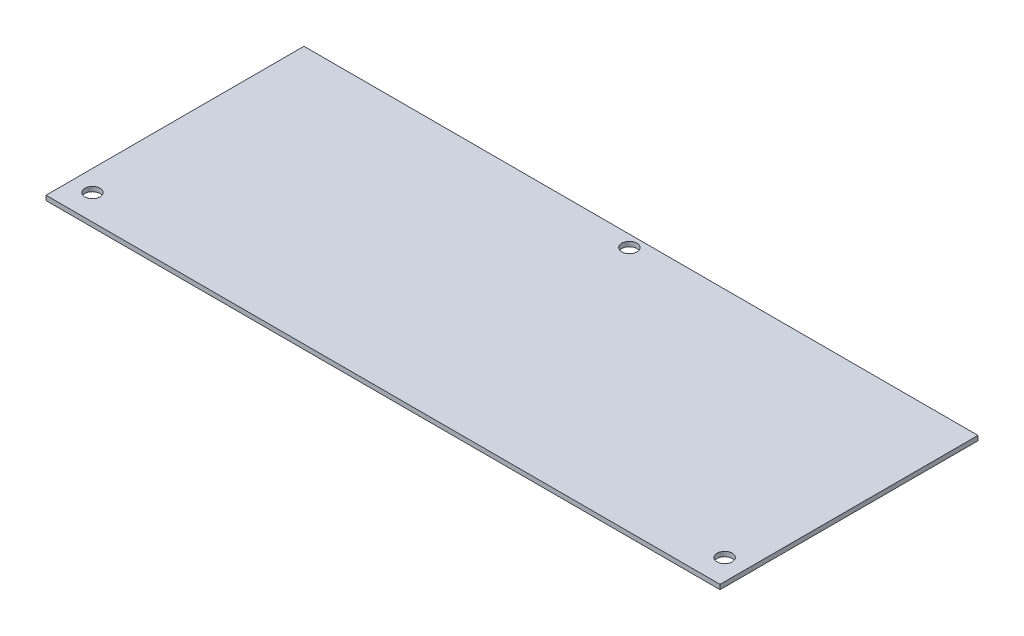
ISO-10303-21;
HEADER;
FILE_DESCRIPTION(('STEP AP214'),'2;1');
FILE_NAME('part.step','',(''),(''),'','','');
FILE_SCHEMA(('AUTOMOTIVE_DESIGN { 1 0 10303 214 1 1 1 1 }'));
ENDSEC;
DATA;
#1=APPLICATION_CONTEXT('core data for automotive mechanical design processes');
#2=APPLICATION_PROTOCOL_DEFINITION('international standard','automotive_design',2000,#1);
#3=PRODUCT_CONTEXT('',#1,'mechanical');
#4=PRODUCT('Part','Part','',(#3));
#5=PRODUCT_RELATED_PRODUCT_CATEGORY('part','',(#4));
#6=PRODUCT_DEFINITION_FORMATION('','',#4);
#7=PRODUCT_DEFINITION_CONTEXT('part definition',#1,'design');
#8=PRODUCT_DEFINITION('design','',#6,#7);
#9=PRODUCT_DEFINITION_SHAPE('','',#8);
#10=(LENGTH_UNIT() NAMED_UNIT(*) SI_UNIT(.MILLI.,.METRE.));
#11=(NAMED_UNIT(*) PLANE_ANGLE_UNIT() SI_UNIT($,.RADIAN.));
#12=(NAMED_UNIT(*) SI_UNIT($,.STERADIAN.) SOLID_ANGLE_UNIT());
#13=UNCERTAINTY_MEASURE_WITH_UNIT(LENGTH_MEASURE(1.E-05),#10,'distance_accuracy_value','');
#14=(GEOMETRIC_REPRESENTATION_CONTEXT(3) GLOBAL_UNCERTAINTY_ASSIGNED_CONTEXT((#13)) GLOBAL_UNIT_ASSIGNED_CONTEXT((#10,
#11,#12)) REPRESENTATION_CONTEXT('',''));
#15=CARTESIAN_POINT('',(0.,0.,0.));
#16=DIRECTION('',(0.,0.,1.));
#17=DIRECTION('',(1.,0.,0.));
#18=AXIS2_PLACEMENT_3D('',#15,#16,#17);
#19=CARTESIAN_POINT('',(0.,2.,0.));
#20=DIRECTION('',(0.,-1.,0.));
#21=DIRECTION('',(0.,0.,-1.));
#22=AXIS2_PLACEMENT_3D('',#19,#20,#21);
#23=PLANE('',#22);
#24=DIRECTION('',(0.,0.,-1.));
#25=VECTOR('',#24,1.);
#26=CARTESIAN_POINT('',(0.,2.,0.));
#27=LINE('',#26,#25);
#28=CARTESIAN_POINT('',(0.,2.,111.));
#29=VERTEX_POINT('',#28);
#30=CARTESIAN_POINT('',(0.,2.,0.));
#31=VERTEX_POINT('',#30);
#32=EDGE_CURVE('E98',#29,#31,#27,.T.);
#33=ORIENTED_EDGE('',*,*,#32,.T.);
#34=DIRECTION('',(-1.,0.,0.));
#35=VECTOR('',#34,1.);
#36=CARTESIAN_POINT('',(0.,2.,0.));
#37=LINE('',#36,#35);
#38=CARTESIAN_POINT('',(-290.,2.,0.));
#39=VERTEX_POINT('',#38);
#40=EDGE_CURVE('E93',#31,#39,#37,.T.);
#41=ORIENTED_EDGE('',*,*,#40,.T.);
#42=DIRECTION('',(0.,0.,1.));
#43=VECTOR('',#42,1.);
#44=CARTESIAN_POINT('',(-290.,2.,0.));
#45=LINE('',#44,#43);
#46=CARTESIAN_POINT('',(-290.,2.,111.));
#47=VERTEX_POINT('',#46);
#48=EDGE_CURVE('E96',#39,#47,#45,.T.);
#49=ORIENTED_EDGE('',*,*,#48,.T.);
#50=DIRECTION('',(1.,0.,0.));
#51=VECTOR('',#50,1.);
#52=CARTESIAN_POINT('',(0.,2.,111.));
#53=LINE('',#52,#51);
#54=EDGE_CURVE('E63',#47,#29,#53,.T.);
#55=ORIENTED_EDGE('',*,*,#54,.T.);
#56=EDGE_LOOP('',(#33,#41,#49,#55));
#57=FACE_BOUND('',#56,.T.);
#58=CARTESIAN_POINT('',(-145.,2.,5.00000000000002));
#59=DIRECTION('',(0.,1.,0.));
#60=DIRECTION('',(0.,0.,1.));
#61=AXIS2_PLACEMENT_3D('',#58,#59,#60);
#62=CIRCLE('',#61,3.25000000000001);
#63=CARTESIAN_POINT('',(-145.,2.,8.25000000000002));
#64=VERTEX_POINT('',#63);
#65=EDGE_CURVE('E118',#64,#64,#62,.T.);
#66=ORIENTED_EDGE('',*,*,#65,.F.);
#67=EDGE_LOOP('',(#66));
#68=FACE_BOUND('',#67,.T.);
#69=CARTESIAN_POINT('',(-281.,2.,100.));
#70=DIRECTION('',(0.,1.,0.));
#71=DIRECTION('',(0.,0.,1.));
#72=AXIS2_PLACEMENT_3D('',#69,#70,#71);
#73=CIRCLE('',#72,3.24999999999995);
#74=CARTESIAN_POINT('',(-281.,2.,103.25));
#75=VERTEX_POINT('',#74);
#76=EDGE_CURVE('E140',#75,#75,#73,.T.);
#77=ORIENTED_EDGE('',*,*,#76,.F.);
#78=EDGE_LOOP('',(#77));
#79=FACE_BOUND('',#78,.T.);
#80=CARTESIAN_POINT('',(-8.99999999999999,2.,100.));
#81=DIRECTION('',(0.,1.,0.));
#82=DIRECTION('',(0.,0.,1.));
#83=AXIS2_PLACEMENT_3D('',#80,#81,#82);
#84=CIRCLE('',#83,3.25);
#85=CARTESIAN_POINT('',(-8.99999999999999,2.,103.25));
#86=VERTEX_POINT('',#85);
#87=EDGE_CURVE('E148',#86,#86,#84,.T.);
#88=ORIENTED_EDGE('',*,*,#87,.F.);
#89=EDGE_LOOP('',(#88));
#90=FACE_BOUND('',#89,.T.);
#91=ADVANCED_FACE('F45',(#57,#68,#79,#90),#23,.F.);
#92=CARTESIAN_POINT('',(0.,0.,0.));
#93=DIRECTION('',(0.,-1.,0.));
#94=DIRECTION('',(0.,0.,-1.));
#95=AXIS2_PLACEMENT_3D('',#92,#93,#94);
#96=PLANE('',#95);
#97=CARTESIAN_POINT('',(-281.,0.,100.));
#98=DIRECTION('',(0.,1.,0.));
#99=DIRECTION('',(0.,0.,1.));
#100=AXIS2_PLACEMENT_3D('',#97,#98,#99);
#101=CIRCLE('',#100,3.24999999999995);
#102=CARTESIAN_POINT('',(-281.,0.,103.25));
#103=VERTEX_POINT('',#102);
#104=EDGE_CURVE('E144',#103,#103,#101,.T.);
#105=ORIENTED_EDGE('',*,*,#104,.T.);
#106=EDGE_LOOP('',(#105));
#107=FACE_BOUND('',#106,.T.);
#108=DIRECTION('',(0.,0.,-1.));
#109=VECTOR('',#108,1.);
#110=CARTESIAN_POINT('',(0.,0.,0.));
#111=LINE('',#110,#109);
#112=CARTESIAN_POINT('',(0.,0.,111.));
#113=VERTEX_POINT('',#112);
#114=CARTESIAN_POINT('',(0.,0.,0.));
#115=VERTEX_POINT('',#114);
#116=EDGE_CURVE('E114',#113,#115,#111,.T.);
#117=ORIENTED_EDGE('',*,*,#116,.F.);
#118=DIRECTION('',(1.,0.,0.));
#119=VECTOR('',#118,1.);
#120=CARTESIAN_POINT('',(0.,0.,111.));
#121=LINE('',#120,#119);
#122=CARTESIAN_POINT('',(-290.,0.,111.));
#123=VERTEX_POINT('',#122);
#124=EDGE_CURVE('E86',#123,#113,#121,.T.);
#125=ORIENTED_EDGE('',*,*,#124,.F.);
#126=DIRECTION('',(0.,0.,1.));
#127=VECTOR('',#126,1.);
#128=CARTESIAN_POINT('',(-290.,0.,0.));
#129=LINE('',#128,#127);
#130=CARTESIAN_POINT('',(-290.,0.,0.));
#131=VERTEX_POINT('',#130);
#132=EDGE_CURVE('E80',#131,#123,#129,.T.);
#133=ORIENTED_EDGE('',*,*,#132,.F.);
#134=DIRECTION('',(-1.,0.,0.));
#135=VECTOR('',#134,1.);
#136=CARTESIAN_POINT('',(0.,0.,0.));
#137=LINE('',#136,#135);
#138=EDGE_CURVE('E103',#115,#131,#137,.T.);
#139=ORIENTED_EDGE('',*,*,#138,.F.);
#140=EDGE_LOOP('',(#117,#125,#133,#139));
#141=FACE_BOUND('',#140,.T.);
#142=CARTESIAN_POINT('',(-145.,0.,5.00000000000002));
#143=DIRECTION('',(0.,1.,0.));
#144=DIRECTION('',(0.,0.,1.));
#145=AXIS2_PLACEMENT_3D('',#142,#143,#144);
#146=CIRCLE('',#145,3.25000000000001);
#147=CARTESIAN_POINT('',(-145.,0.,8.25000000000002));
#148=VERTEX_POINT('',#147);
#149=EDGE_CURVE('E136',#148,#148,#146,.T.);
#150=ORIENTED_EDGE('',*,*,#149,.T.);
#151=EDGE_LOOP('',(#150));
#152=FACE_BOUND('',#151,.T.);
#153=CARTESIAN_POINT('',(-8.99999999999999,0.,100.));
#154=DIRECTION('',(0.,1.,0.));
#155=DIRECTION('',(0.,0.,1.));
#156=AXIS2_PLACEMENT_3D('',#153,#154,#155);
#157=CIRCLE('',#156,3.25);
#158=CARTESIAN_POINT('',(-8.99999999999999,0.,103.25));
#159=VERTEX_POINT('',#158);
#160=EDGE_CURVE('E152',#159,#159,#157,.T.);
#161=ORIENTED_EDGE('',*,*,#160,.T.);
#162=EDGE_LOOP('',(#161));
#163=FACE_BOUND('',#162,.T.);
#164=ADVANCED_FACE('F131',(#107,#141,#152,#163),#96,.T.);
#165=CARTESIAN_POINT('',(0.,2.,0.));
#166=DIRECTION('',(-1.,0.,0.));
#167=DIRECTION('',(0.,0.,1.));
#168=AXIS2_PLACEMENT_3D('',#165,#166,#167);
#169=PLANE('',#168);
#170=ORIENTED_EDGE('',*,*,#116,.T.);
#171=DIRECTION('',(0.,-1.,0.));
#172=VECTOR('',#171,1.);
#173=CARTESIAN_POINT('',(0.,2.,0.));
#174=LINE('',#173,#172);
#175=EDGE_CURVE('E11',#31,#115,#174,.T.);
#176=ORIENTED_EDGE('',*,*,#175,.F.);
#177=ORIENTED_EDGE('',*,*,#32,.F.);
#178=DIRECTION('',(0.,-1.,0.));
#179=VECTOR('',#178,1.);
#180=CARTESIAN_POINT('',(0.,2.,111.));
#181=LINE('',#180,#179);
#182=EDGE_CURVE('E110',#29,#113,#181,.T.);
#183=ORIENTED_EDGE('',*,*,#182,.T.);
#184=EDGE_LOOP('',(#170,#176,#177,#183));
#185=FACE_BOUND('',#184,.T.);
#186=ADVANCED_FACE('F47',(#185),#169,.F.);
#187=CARTESIAN_POINT('',(0.,2.,0.));
#188=DIRECTION('',(0.,0.,1.));
#189=DIRECTION('',(1.,0.,0.));
#190=AXIS2_PLACEMENT_3D('',#187,#188,#189);
#191=PLANE('',#190);
#192=ORIENTED_EDGE('',*,*,#138,.T.);
#193=DIRECTION('',(0.,-1.,0.));
#194=VECTOR('',#193,1.);
#195=CARTESIAN_POINT('',(-290.,2.,0.));
#196=LINE('',#195,#194);
#197=EDGE_CURVE('E55',#39,#131,#196,.T.);
#198=ORIENTED_EDGE('',*,*,#197,.F.);
#199=ORIENTED_EDGE('',*,*,#40,.F.);
#200=ORIENTED_EDGE('',*,*,#175,.T.);
#201=EDGE_LOOP('',(#192,#198,#199,#200));
#202=FACE_BOUND('',#201,.T.);
#203=ADVANCED_FACE('F102',(#202),#191,.F.);
#204=CARTESIAN_POINT('',(-290.,2.,0.));
#205=DIRECTION('',(1.,0.,0.));
#206=DIRECTION('',(0.,0.,-1.));
#207=AXIS2_PLACEMENT_3D('',#204,#205,#206);
#208=PLANE('',#207);
#209=ORIENTED_EDGE('',*,*,#132,.T.);
#210=DIRECTION('',(0.,-1.,0.));
#211=VECTOR('',#210,1.);
#212=CARTESIAN_POINT('',(-290.,2.,111.));
#213=LINE('',#212,#211);
#214=EDGE_CURVE('E105',#47,#123,#213,.T.);
#215=ORIENTED_EDGE('',*,*,#214,.F.);
#216=ORIENTED_EDGE('',*,*,#48,.F.);
#217=ORIENTED_EDGE('',*,*,#197,.T.);
#218=EDGE_LOOP('',(#209,#215,#216,#217));
#219=FACE_BOUND('',#218,.T.);
#220=ADVANCED_FACE('F106',(#219),#208,.F.);
#221=CARTESIAN_POINT('',(0.,2.,111.));
#222=DIRECTION('',(0.,0.,-1.));
#223=DIRECTION('',(-1.,0.,0.));
#224=AXIS2_PLACEMENT_3D('',#221,#222,#223);
#225=PLANE('',#224);
#226=ORIENTED_EDGE('',*,*,#124,.T.);
#227=ORIENTED_EDGE('',*,*,#182,.F.);
#228=ORIENTED_EDGE('',*,*,#54,.F.);
#229=ORIENTED_EDGE('',*,*,#214,.T.);
#230=EDGE_LOOP('',(#226,#227,#228,#229));
#231=FACE_BOUND('',#230,.T.);
#232=ADVANCED_FACE('F128',(#231),#225,.F.);
#233=CARTESIAN_POINT('',(-145.,2.,5.00000000000002));
#234=DIRECTION('',(0.,-1.,0.));
#235=DIRECTION('',(0.,0.,-1.));
#236=AXIS2_PLACEMENT_3D('',#233,#234,#235);
#237=CYLINDRICAL_SURFACE('',#236,3.25000000000001);
#238=ORIENTED_EDGE('',*,*,#65,.T.);
#239=EDGE_LOOP('',(#238));
#240=FACE_BOUND('',#239,.T.);
#241=ORIENTED_EDGE('',*,*,#149,.F.);
#242=EDGE_LOOP('',(#241));
#243=FACE_BOUND('',#242,.T.);
#244=ADVANCED_FACE('F171',(#240,#243),#237,.F.);
#245=CARTESIAN_POINT('',(-281.,2.,100.));
#246=DIRECTION('',(0.,-1.,0.));
#247=DIRECTION('',(0.,0.,-1.));
#248=AXIS2_PLACEMENT_3D('',#245,#246,#247);
#249=CYLINDRICAL_SURFACE('',#248,3.24999999999995);
#250=ORIENTED_EDGE('',*,*,#76,.T.);
#251=EDGE_LOOP('',(#250));
#252=FACE_BOUND('',#251,.T.);
#253=ORIENTED_EDGE('',*,*,#104,.F.);
#254=EDGE_LOOP('',(#253));
#255=FACE_BOUND('',#254,.T.);
#256=ADVANCED_FACE('F216',(#252,#255),#249,.F.);
#257=CARTESIAN_POINT('',(-8.99999999999999,2.,100.));
#258=DIRECTION('',(0.,-1.,0.));
#259=DIRECTION('',(0.,0.,-1.));
#260=AXIS2_PLACEMENT_3D('',#257,#258,#259);
#261=CYLINDRICAL_SURFACE('',#260,3.25);
#262=ORIENTED_EDGE('',*,*,#87,.T.);
#263=EDGE_LOOP('',(#262));
#264=FACE_BOUND('',#263,.T.);
#265=ORIENTED_EDGE('',*,*,#160,.F.);
#266=EDGE_LOOP('',(#265));
#267=FACE_BOUND('',#266,.T.);
#268=ADVANCED_FACE('F160',(#264,#267),#261,.F.);
#269=CLOSED_SHELL('',(#91,#164,#186,#203,#220,#232,#244,#256,#268));
#270=MANIFOLD_SOLID_BREP('B2',#269);
#271=ADVANCED_BREP_SHAPE_REPRESENTATION('',(#18,#270),#14);
#272=SHAPE_DEFINITION_REPRESENTATION(#9,#271);
ENDSEC;
END-ISO-10303-21;
